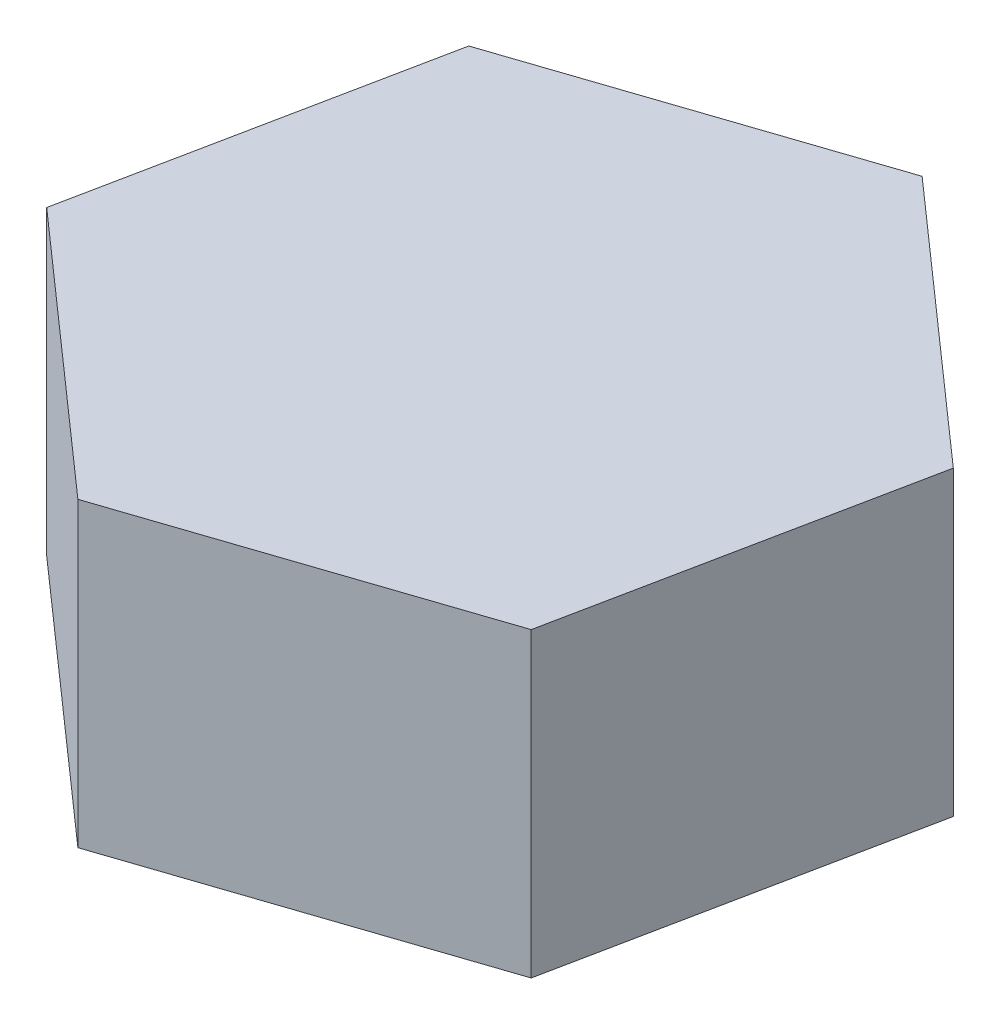
ISO-10303-21;
HEADER;
FILE_DESCRIPTION(('STEP AP214'),'2;1');
FILE_NAME('part.step','',(''),(''),'','','');
FILE_SCHEMA(('AUTOMOTIVE_DESIGN { 1 0 10303 214 1 1 1 1 }'));
ENDSEC;
DATA;
#1=APPLICATION_CONTEXT('core data for automotive mechanical design processes');
#2=APPLICATION_PROTOCOL_DEFINITION('international standard','automotive_design',2000,#1);
#3=PRODUCT_CONTEXT('',#1,'mechanical');
#4=PRODUCT('Part','Part','',(#3));
#5=PRODUCT_RELATED_PRODUCT_CATEGORY('part','',(#4));
#6=PRODUCT_DEFINITION_FORMATION('','',#4);
#7=PRODUCT_DEFINITION_CONTEXT('part definition',#1,'design');
#8=PRODUCT_DEFINITION('design','',#6,#7);
#9=PRODUCT_DEFINITION_SHAPE('','',#8);
#10=(LENGTH_UNIT() NAMED_UNIT(*) SI_UNIT(.MILLI.,.METRE.));
#11=(NAMED_UNIT(*) PLANE_ANGLE_UNIT() SI_UNIT($,.RADIAN.));
#12=(NAMED_UNIT(*) SI_UNIT($,.STERADIAN.) SOLID_ANGLE_UNIT());
#13=UNCERTAINTY_MEASURE_WITH_UNIT(LENGTH_MEASURE(1.E-05),#10,'distance_accuracy_value','');
#14=(GEOMETRIC_REPRESENTATION_CONTEXT(3) GLOBAL_UNCERTAINTY_ASSIGNED_CONTEXT((#13)) GLOBAL_UNIT_ASSIGNED_CONTEXT((#10,
#11,#12)) REPRESENTATION_CONTEXT('',''));
#15=CARTESIAN_POINT('',(0.,0.,0.));
#16=DIRECTION('',(0.,0.,1.));
#17=DIRECTION('',(1.,0.,0.));
#18=AXIS2_PLACEMENT_3D('',#15,#16,#17);
#19=CARTESIAN_POINT('',(2.02541354685856,1.8,-0.678994324906958));
#20=DIRECTION('',(-0.980039636860258,0.,-0.198802188576517));
#21=DIRECTION('',(0.198802188576517,0.,-0.980039636860258));
#22=AXIS2_PLACEMENT_3D('',#19,#20,#21);
#23=PLANE('',#22);
#24=DIRECTION('',(-0.198802188576517,0.,0.980039636860258));
#25=VECTOR('',#24,1.);
#26=CARTESIAN_POINT('',(2.02541354685856,0.,-0.678994324906958));
#27=LINE('',#26,#25);
#28=CARTESIAN_POINT('',(2.02541354685856,0.,-0.678994324906958));
#29=VERTEX_POINT('',#28);
#30=CARTESIAN_POINT('',(1.60073310782417,0.,1.41456242229518));
#31=VERTEX_POINT('',#30);
#32=EDGE_CURVE('E126',#29,#31,#27,.T.);
#33=ORIENTED_EDGE('',*,*,#32,.F.);
#34=DIRECTION('',(0.,-1.,0.));
#35=VECTOR('',#34,1.);
#36=CARTESIAN_POINT('',(2.02541354685856,1.8,-0.678994324906958));
#37=LINE('',#36,#35);
#38=CARTESIAN_POINT('',(2.02541354685856,1.8,-0.678994324906958));
#39=VERTEX_POINT('',#38);
#40=EDGE_CURVE('E125',#39,#29,#37,.T.);
#41=ORIENTED_EDGE('',*,*,#40,.F.);
#42=DIRECTION('',(-0.198802188576517,0.,0.980039636860258));
#43=VECTOR('',#42,1.);
#44=CARTESIAN_POINT('',(2.02541354685856,1.8,-0.678994324906958));
#45=LINE('',#44,#43);
#46=CARTESIAN_POINT('',(1.60073310782417,1.8,1.41456242229518));
#47=VERTEX_POINT('',#46);
#48=EDGE_CURVE('E138',#39,#47,#45,.T.);
#49=ORIENTED_EDGE('',*,*,#48,.T.);
#50=DIRECTION('',(0.,-1.,0.));
#51=VECTOR('',#50,1.);
#52=CARTESIAN_POINT('',(1.60073310782417,1.8,1.41456242229518));
#53=LINE('',#52,#51);
#54=EDGE_CURVE('E11',#47,#31,#53,.T.);
#55=ORIENTED_EDGE('',*,*,#54,.T.);
#56=EDGE_LOOP('',(#33,#41,#49,#55));
#57=FACE_BOUND('',#56,.T.);
#58=ADVANCED_FACE('F43',(#57),#23,.F.);
#59=CARTESIAN_POINT('',(1.60073310782417,1.8,1.41456242229518));
#60=DIRECTION('',(-0.317852072794921,0.,-0.948140316524918));
#61=DIRECTION('',(0.948140316524918,0.,-0.317852072794921));
#62=AXIS2_PLACEMENT_3D('',#59,#60,#61);
#63=PLANE('',#62);
#64=DIRECTION('',(-0.948140316524918,0.,0.317852072794921));
#65=VECTOR('',#64,1.);
#66=CARTESIAN_POINT('',(1.60073310782417,0.,1.41456242229518));
#67=LINE('',#66,#65);
#68=CARTESIAN_POINT('',(-0.42468043903439,0.,2.09355674720214));
#69=VERTEX_POINT('',#68);
#70=EDGE_CURVE('E128',#31,#69,#67,.T.);
#71=ORIENTED_EDGE('',*,*,#70,.F.);
#72=ORIENTED_EDGE('',*,*,#54,.F.);
#73=DIRECTION('',(-0.948140316524918,0.,0.317852072794921));
#74=VECTOR('',#73,1.);
#75=CARTESIAN_POINT('',(1.60073310782417,1.8,1.41456242229518));
#76=LINE('',#75,#74);
#77=CARTESIAN_POINT('',(-0.42468043903439,1.8,2.09355674720214));
#78=VERTEX_POINT('',#77);
#79=EDGE_CURVE('E91',#47,#78,#76,.T.);
#80=ORIENTED_EDGE('',*,*,#79,.T.);
#81=DIRECTION('',(0.,-1.,0.));
#82=VECTOR('',#81,1.);
#83=CARTESIAN_POINT('',(-0.42468043903439,1.8,2.09355674720214));
#84=LINE('',#83,#82);
#85=EDGE_CURVE('E51',#78,#69,#84,.T.);
#86=ORIENTED_EDGE('',*,*,#85,.T.);
#87=EDGE_LOOP('',(#71,#72,#80,#86));
#88=FACE_BOUND('',#87,.T.);
#89=ADVANCED_FACE('F144',(#88),#63,.F.);
#90=CARTESIAN_POINT('',(-0.42468043903439,1.8,2.09355674720214));
#91=DIRECTION('',(0.662187564065338,0.,-0.749338127948401));
#92=DIRECTION('',(0.749338127948401,0.,0.662187564065338));
#93=AXIS2_PLACEMENT_3D('',#90,#91,#92);
#94=PLANE('',#93);
#95=DIRECTION('',(-0.749338127948401,0.,-0.662187564065338));
#96=VECTOR('',#95,1.);
#97=CARTESIAN_POINT('',(-0.42468043903439,0.,2.09355674720214));
#98=LINE('',#97,#96);
#99=CARTESIAN_POINT('',(-2.02541354685856,0.,0.678994324906957));
#100=VERTEX_POINT('',#99);
#101=EDGE_CURVE('E131',#69,#100,#98,.T.);
#102=ORIENTED_EDGE('',*,*,#101,.F.);
#103=ORIENTED_EDGE('',*,*,#85,.F.);
#104=DIRECTION('',(-0.749338127948401,0.,-0.662187564065338));
#105=VECTOR('',#104,1.);
#106=CARTESIAN_POINT('',(-0.42468043903439,1.8,2.09355674720214));
#107=LINE('',#106,#105);
#108=CARTESIAN_POINT('',(-2.02541354685856,1.8,0.678994324906957));
#109=VERTEX_POINT('',#108);
#110=EDGE_CURVE('E119',#78,#109,#107,.T.);
#111=ORIENTED_EDGE('',*,*,#110,.T.);
#112=DIRECTION('',(0.,-1.,0.));
#113=VECTOR('',#112,1.);
#114=CARTESIAN_POINT('',(-2.02541354685856,1.8,0.678994324906957));
#115=LINE('',#114,#113);
#116=EDGE_CURVE('E113',#109,#100,#115,.T.);
#117=ORIENTED_EDGE('',*,*,#116,.T.);
#118=EDGE_LOOP('',(#102,#103,#111,#117));
#119=FACE_BOUND('',#118,.T.);
#120=ADVANCED_FACE('F166',(#119),#94,.F.);
#121=CARTESIAN_POINT('',(-2.02541354685856,1.8,0.678994324906957));
#122=DIRECTION('',(0.980039636860258,0.,0.198802188576518));
#123=DIRECTION('',(-0.198802188576518,0.,0.980039636860258));
#124=AXIS2_PLACEMENT_3D('',#121,#122,#123);
#125=PLANE('',#124);
#126=DIRECTION('',(0.198802188576518,0.,-0.980039636860258));
#127=VECTOR('',#126,1.);
#128=CARTESIAN_POINT('',(-2.02541354685856,0.,0.678994324906957));
#129=LINE('',#128,#127);
#130=CARTESIAN_POINT('',(-1.60073310782417,0.,-1.41456242229518));
#131=VERTEX_POINT('',#130);
#132=EDGE_CURVE('E134',#100,#131,#129,.T.);
#133=ORIENTED_EDGE('',*,*,#132,.F.);
#134=ORIENTED_EDGE('',*,*,#116,.F.);
#135=DIRECTION('',(0.198802188576518,0.,-0.980039636860258));
#136=VECTOR('',#135,1.);
#137=CARTESIAN_POINT('',(-2.02541354685856,1.8,0.678994324906957));
#138=LINE('',#137,#136);
#139=CARTESIAN_POINT('',(-1.60073310782417,1.8,-1.41456242229518));
#140=VERTEX_POINT('',#139);
#141=EDGE_CURVE('E103',#109,#140,#138,.T.);
#142=ORIENTED_EDGE('',*,*,#141,.T.);
#143=DIRECTION('',(0.,-1.,0.));
#144=VECTOR('',#143,1.);
#145=CARTESIAN_POINT('',(-1.60073310782417,1.8,-1.41456242229518));
#146=LINE('',#145,#144);
#147=EDGE_CURVE('E108',#140,#131,#146,.T.);
#148=ORIENTED_EDGE('',*,*,#147,.T.);
#149=EDGE_LOOP('',(#133,#134,#142,#148));
#150=FACE_BOUND('',#149,.T.);
#151=ADVANCED_FACE('F116',(#150),#125,.F.);
#152=CARTESIAN_POINT('',(-1.60073310782417,1.8,-1.41456242229518));
#153=DIRECTION('',(0.317852072794921,0.,0.948140316524918));
#154=DIRECTION('',(-0.948140316524918,0.,0.317852072794921));
#155=AXIS2_PLACEMENT_3D('',#152,#153,#154);
#156=PLANE('',#155);
#157=DIRECTION('',(0.948140316524918,0.,-0.317852072794921));
#158=VECTOR('',#157,1.);
#159=CARTESIAN_POINT('',(-1.60073310782417,0.,-1.41456242229518));
#160=LINE('',#159,#158);
#161=CARTESIAN_POINT('',(0.424680439034392,0.,-2.09355674720214));
#162=VERTEX_POINT('',#161);
#163=EDGE_CURVE('E110',#131,#162,#160,.T.);
#164=ORIENTED_EDGE('',*,*,#163,.F.);
#165=ORIENTED_EDGE('',*,*,#147,.F.);
#166=DIRECTION('',(0.948140316524918,0.,-0.317852072794921));
#167=VECTOR('',#166,1.);
#168=CARTESIAN_POINT('',(-1.60073310782417,1.8,-1.41456242229518));
#169=LINE('',#168,#167);
#170=CARTESIAN_POINT('',(0.424680439034392,1.8,-2.09355674720214));
#171=VERTEX_POINT('',#170);
#172=EDGE_CURVE('E99',#140,#171,#169,.T.);
#173=ORIENTED_EDGE('',*,*,#172,.T.);
#174=DIRECTION('',(0.,-1.,0.));
#175=VECTOR('',#174,1.);
#176=CARTESIAN_POINT('',(0.424680439034392,1.8,-2.09355674720214));
#177=LINE('',#176,#175);
#178=EDGE_CURVE('E114',#171,#162,#177,.T.);
#179=ORIENTED_EDGE('',*,*,#178,.T.);
#180=EDGE_LOOP('',(#164,#165,#173,#179));
#181=FACE_BOUND('',#180,.T.);
#182=ADVANCED_FACE('F109',(#181),#156,.F.);
#183=CARTESIAN_POINT('',(0.424680439034392,1.8,-2.09355674720214));
#184=DIRECTION('',(-0.662187564065338,0.,0.749338127948401));
#185=DIRECTION('',(-0.749338127948401,0.,-0.662187564065338));
#186=AXIS2_PLACEMENT_3D('',#183,#184,#185);
#187=PLANE('',#186);
#188=DIRECTION('',(0.749338127948401,0.,0.662187564065338));
#189=VECTOR('',#188,1.);
#190=CARTESIAN_POINT('',(0.424680439034392,0.,-2.09355674720214));
#191=LINE('',#190,#189);
#192=EDGE_CURVE('E79',#162,#29,#191,.T.);
#193=ORIENTED_EDGE('',*,*,#192,.F.);
#194=ORIENTED_EDGE('',*,*,#178,.F.);
#195=DIRECTION('',(0.749338127948401,0.,0.662187564065338));
#196=VECTOR('',#195,1.);
#197=CARTESIAN_POINT('',(0.424680439034392,1.8,-2.09355674720214));
#198=LINE('',#197,#196);
#199=EDGE_CURVE('E59',#171,#39,#198,.T.);
#200=ORIENTED_EDGE('',*,*,#199,.T.);
#201=ORIENTED_EDGE('',*,*,#40,.T.);
#202=EDGE_LOOP('',(#193,#194,#200,#201));
#203=FACE_BOUND('',#202,.T.);
#204=ADVANCED_FACE('F152',(#203),#187,.F.);
#205=CARTESIAN_POINT('',(0.,1.8,0.));
#206=DIRECTION('',(0.,1.,0.));
#207=DIRECTION('',(0.,0.,-1.));
#208=AXIS2_PLACEMENT_3D('',#205,#206,#207);
#209=PLANE('',#208);
#210=ORIENTED_EDGE('',*,*,#48,.F.);
#211=ORIENTED_EDGE('',*,*,#199,.F.);
#212=ORIENTED_EDGE('',*,*,#172,.F.);
#213=ORIENTED_EDGE('',*,*,#141,.F.);
#214=ORIENTED_EDGE('',*,*,#110,.F.);
#215=ORIENTED_EDGE('',*,*,#79,.F.);
#216=EDGE_LOOP('',(#210,#211,#212,#213,#214,#215));
#217=FACE_BOUND('',#216,.T.);
#218=ADVANCED_FACE('F101',(#217),#209,.T.);
#219=CARTESIAN_POINT('',(0.,0.,0.));
#220=DIRECTION('',(0.,1.,0.));
#221=DIRECTION('',(0.,0.,-1.));
#222=AXIS2_PLACEMENT_3D('',#219,#220,#221);
#223=PLANE('',#222);
#224=ORIENTED_EDGE('',*,*,#32,.T.);
#225=ORIENTED_EDGE('',*,*,#70,.T.);
#226=ORIENTED_EDGE('',*,*,#101,.T.);
#227=ORIENTED_EDGE('',*,*,#132,.T.);
#228=ORIENTED_EDGE('',*,*,#163,.T.);
#229=ORIENTED_EDGE('',*,*,#192,.T.);
#230=EDGE_LOOP('',(#224,#225,#226,#227,#228,#229));
#231=FACE_BOUND('',#230,.T.);
#232=ADVANCED_FACE('F146',(#231),#223,.F.);
#233=CLOSED_SHELL('',(#58,#89,#120,#151,#182,#204,#218,#232));
#234=MANIFOLD_SOLID_BREP('B2',#233);
#235=ADVANCED_BREP_SHAPE_REPRESENTATION('',(#18,#234),#14);
#236=SHAPE_DEFINITION_REPRESENTATION(#9,#235);
ENDSEC;
END-ISO-10303-21;
